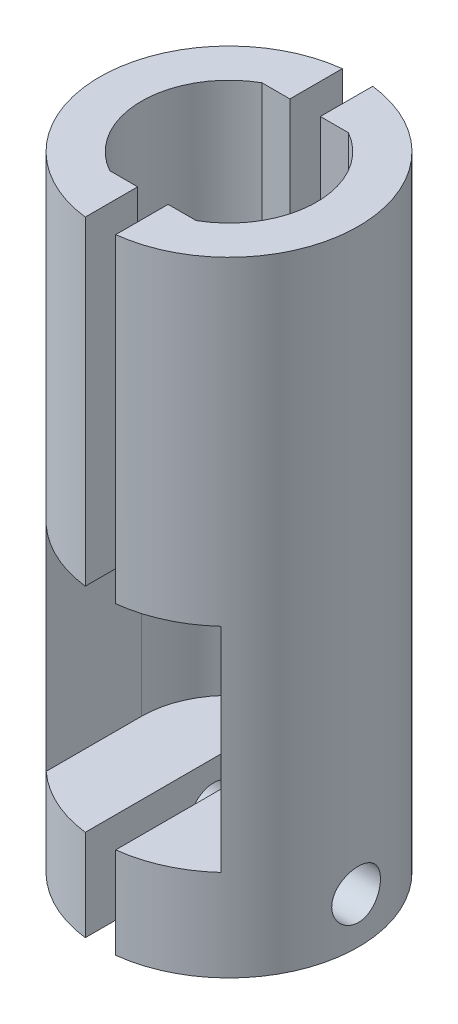
ISO-10303-21;
HEADER;
FILE_DESCRIPTION(('STEP AP214'),'2;1');
FILE_NAME('part.step','',(''),(''),'','','');
FILE_SCHEMA(('AUTOMOTIVE_DESIGN { 1 0 10303 214 1 1 1 1 }'));
ENDSEC;
DATA;
#1=APPLICATION_CONTEXT('core data for automotive mechanical design processes');
#2=APPLICATION_PROTOCOL_DEFINITION('international standard','automotive_design',2000,#1);
#3=PRODUCT_CONTEXT('',#1,'mechanical');
#4=PRODUCT('Part','Part','',(#3));
#5=PRODUCT_RELATED_PRODUCT_CATEGORY('part','',(#4));
#6=PRODUCT_DEFINITION_FORMATION('','',#4);
#7=PRODUCT_DEFINITION_CONTEXT('part definition',#1,'design');
#8=PRODUCT_DEFINITION('design','',#6,#7);
#9=PRODUCT_DEFINITION_SHAPE('','',#8);
#10=(LENGTH_UNIT() NAMED_UNIT(*) SI_UNIT(.MILLI.,.METRE.));
#11=(NAMED_UNIT(*) PLANE_ANGLE_UNIT() SI_UNIT($,.RADIAN.));
#12=(NAMED_UNIT(*) SI_UNIT($,.STERADIAN.) SOLID_ANGLE_UNIT());
#13=UNCERTAINTY_MEASURE_WITH_UNIT(LENGTH_MEASURE(1.E-05),#10,'distance_accuracy_value','');
#14=(GEOMETRIC_REPRESENTATION_CONTEXT(3) GLOBAL_UNCERTAINTY_ASSIGNED_CONTEXT((#13)) GLOBAL_UNIT_ASSIGNED_CONTEXT((#10,
#11,#12)) REPRESENTATION_CONTEXT('',''));
#15=CARTESIAN_POINT('',(0.,0.,0.));
#16=DIRECTION('',(0.,0.,1.));
#17=DIRECTION('',(1.,0.,0.));
#18=AXIS2_PLACEMENT_3D('',#15,#16,#17);
#19=CARTESIAN_POINT('',(0.,0.,0.));
#20=DIRECTION('',(0.,1.,0.));
#21=DIRECTION('',(0.,0.,1.));
#22=AXIS2_PLACEMENT_3D('',#19,#20,#21);
#23=PLANE('',#22);
#24=DIRECTION('',(0.,0.,-1.));
#25=VECTOR('',#24,1.);
#26=CARTESIAN_POINT('',(5.75,0.,0.));
#27=LINE('',#26,#25);
#28=CARTESIAN_POINT('',(5.75,0.,6.25999201277446));
#29=VERTEX_POINT('',#28);
#30=CARTESIAN_POINT('',(5.75,0.,0.));
#31=VERTEX_POINT('',#30);
#32=EDGE_CURVE('E67',#29,#31,#27,.T.);
#33=ORIENTED_EDGE('',*,*,#32,.F.);
#34=CARTESIAN_POINT('',(0.,0.,0.));
#35=DIRECTION('',(0.,1.,0.));
#36=DIRECTION('',(0.,0.,1.));
#37=AXIS2_PLACEMENT_3D('',#34,#35,#36);
#38=CIRCLE('',#37,8.5);
#39=CARTESIAN_POINT('',(1.,0.,8.44097150806707));
#40=VERTEX_POINT('',#39);
#41=EDGE_CURVE('E158',#40,#29,#38,.T.);
#42=ORIENTED_EDGE('',*,*,#41,.F.);
#43=DIRECTION('',(0.,0.,1.));
#44=VECTOR('',#43,1.);
#45=CARTESIAN_POINT('',(1.,0.,8.44097150806707));
#46=LINE('',#45,#44);
#47=CARTESIAN_POINT('',(1.,0.,5.));
#48=VERTEX_POINT('',#47);
#49=EDGE_CURVE('E95',#48,#40,#46,.T.);
#50=ORIENTED_EDGE('',*,*,#49,.F.);
#51=DIRECTION('',(-1.,0.,0.));
#52=VECTOR('',#51,1.);
#53=CARTESIAN_POINT('',(2.83945417290014,0.,5.));
#54=LINE('',#53,#52);
#55=CARTESIAN_POINT('',(2.83945417290014,0.,5.));
#56=VERTEX_POINT('',#55);
#57=EDGE_CURVE('E152',#56,#48,#54,.T.);
#58=ORIENTED_EDGE('',*,*,#57,.F.);
#59=CARTESIAN_POINT('',(0.,0.,0.));
#60=DIRECTION('',(0.,-1.,0.));
#61=DIRECTION('',(0.,0.,1.));
#62=AXIS2_PLACEMENT_3D('',#59,#60,#61);
#63=CIRCLE('',#62,5.75);
#64=EDGE_CURVE('E149',#31,#56,#63,.T.);
#65=ORIENTED_EDGE('',*,*,#64,.F.);
#66=EDGE_LOOP('',(#33,#42,#50,#58,#65));
#67=FACE_BOUND('',#66,.T.);
#68=ADVANCED_FACE('F50',(#67),#23,.F.);
#69=CARTESIAN_POINT('',(0.,21.,0.));
#70=DIRECTION('',(0.,-1.,0.));
#71=DIRECTION('',(0.,0.,-1.));
#72=AXIS2_PLACEMENT_3D('',#69,#70,#71);
#73=CYLINDRICAL_SURFACE('',#72,5.75);
#74=DIRECTION('',(0.,-1.,0.));
#75=VECTOR('',#74,1.);
#76=CARTESIAN_POINT('',(2.83945417290014,21.,-5.));
#77=LINE('',#76,#75);
#78=CARTESIAN_POINT('',(2.83945417290014,21.,-5.));
#79=VERTEX_POINT('',#78);
#80=CARTESIAN_POINT('',(2.83945417290014,-14.,-5.));
#81=VERTEX_POINT('',#80);
#82=EDGE_CURVE('E145',#79,#81,#77,.T.);
#83=ORIENTED_EDGE('',*,*,#82,.T.);
#84=CARTESIAN_POINT('',(0.,-14.,0.));
#85=DIRECTION('',(0.,1.,0.));
#86=DIRECTION('',(0.,0.,-1.));
#87=AXIS2_PLACEMENT_3D('',#84,#85,#86);
#88=CIRCLE('',#87,5.75);
#89=CARTESIAN_POINT('',(5.75,-14.,0.));
#90=VERTEX_POINT('',#89);
#91=EDGE_CURVE('E207',#90,#81,#88,.T.);
#92=ORIENTED_EDGE('',*,*,#91,.F.);
#93=DIRECTION('',(0.,1.,0.));
#94=VECTOR('',#93,1.);
#95=CARTESIAN_POINT('',(5.75,-14.,0.));
#96=LINE('',#95,#94);
#97=EDGE_CURVE('E187',#90,#31,#96,.T.);
#98=ORIENTED_EDGE('',*,*,#97,.T.);
#99=ORIENTED_EDGE('',*,*,#64,.T.);
#100=DIRECTION('',(0.,-1.,0.));
#101=VECTOR('',#100,1.);
#102=CARTESIAN_POINT('',(2.83945417290014,21.,5.));
#103=LINE('',#102,#101);
#104=CARTESIAN_POINT('',(2.83945417290014,21.,5.));
#105=VERTEX_POINT('',#104);
#106=EDGE_CURVE('E12',#105,#56,#103,.T.);
#107=ORIENTED_EDGE('',*,*,#106,.F.);
#108=CARTESIAN_POINT('',(0.,21.,0.));
#109=DIRECTION('',(0.,-1.,0.));
#110=DIRECTION('',(0.,0.,1.));
#111=AXIS2_PLACEMENT_3D('',#108,#109,#110);
#112=CIRCLE('',#111,5.75);
#113=EDGE_CURVE('E161',#79,#105,#112,.T.);
#114=ORIENTED_EDGE('',*,*,#113,.F.);
#115=EDGE_LOOP('',(#83,#92,#98,#99,#107,#114));
#116=FACE_BOUND('',#115,.T.);
#117=ADVANCED_FACE('F52',(#116),#73,.F.);
#118=CARTESIAN_POINT('',(2.83945417290014,21.,5.));
#119=DIRECTION('',(0.,0.,1.));
#120=DIRECTION('',(1.,0.,0.));
#121=AXIS2_PLACEMENT_3D('',#118,#119,#120);
#122=PLANE('',#121);
#123=ORIENTED_EDGE('',*,*,#57,.T.);
#124=DIRECTION('',(0.,-1.,0.));
#125=VECTOR('',#124,1.);
#126=CARTESIAN_POINT('',(1.,21.,5.));
#127=LINE('',#126,#125);
#128=CARTESIAN_POINT('',(1.,21.,5.));
#129=VERTEX_POINT('',#128);
#130=EDGE_CURVE('E60',#129,#48,#127,.T.);
#131=ORIENTED_EDGE('',*,*,#130,.F.);
#132=DIRECTION('',(-1.,0.,0.));
#133=VECTOR('',#132,1.);
#134=CARTESIAN_POINT('',(2.83945417290014,21.,5.));
#135=LINE('',#134,#133);
#136=EDGE_CURVE('E103',#105,#129,#135,.T.);
#137=ORIENTED_EDGE('',*,*,#136,.F.);
#138=ORIENTED_EDGE('',*,*,#106,.T.);
#139=EDGE_LOOP('',(#123,#131,#137,#138));
#140=FACE_BOUND('',#139,.T.);
#141=ADVANCED_FACE('F346',(#140),#122,.F.);
#142=CARTESIAN_POINT('',(1.,21.,8.44097150806707));
#143=DIRECTION('',(1.,0.,0.));
#144=DIRECTION('',(0.,0.,-1.));
#145=AXIS2_PLACEMENT_3D('',#142,#143,#144);
#146=PLANE('',#145);
#147=ORIENTED_EDGE('',*,*,#49,.T.);
#148=DIRECTION('',(0.,-1.,0.));
#149=VECTOR('',#148,1.);
#150=CARTESIAN_POINT('',(1.,21.,8.44097150806707));
#151=LINE('',#150,#149);
#152=CARTESIAN_POINT('',(1.,21.,8.44097150806707));
#153=VERTEX_POINT('',#152);
#154=EDGE_CURVE('E136',#153,#40,#151,.T.);
#155=ORIENTED_EDGE('',*,*,#154,.F.);
#156=DIRECTION('',(0.,0.,1.));
#157=VECTOR('',#156,1.);
#158=CARTESIAN_POINT('',(1.,21.,8.44097150806707));
#159=LINE('',#158,#157);
#160=EDGE_CURVE('E120',#129,#153,#159,.T.);
#161=ORIENTED_EDGE('',*,*,#160,.F.);
#162=ORIENTED_EDGE('',*,*,#130,.T.);
#163=EDGE_LOOP('',(#147,#155,#161,#162));
#164=FACE_BOUND('',#163,.T.);
#165=ADVANCED_FACE('F172',(#164),#146,.F.);
#166=CARTESIAN_POINT('',(0.,21.,0.));
#167=DIRECTION('',(0.,-1.,0.));
#168=DIRECTION('',(0.,0.,-1.));
#169=AXIS2_PLACEMENT_3D('',#166,#167,#168);
#170=CYLINDRICAL_SURFACE('',#169,8.5);
#171=CARTESIAN_POINT('',(8.34805366537614,-17.,-1.6));
#172=CARTESIAN_POINT('',(8.34805539139312,-17.08901429481,-1.59999659237136));
#173=CARTESIAN_POINT('',(8.34949285007406,-17.1780727251556,-1.59254647274993));
#174=CARTESIAN_POINT('',(8.35508013689202,-17.3536778830659,-1.56296320217409));
#175=CARTESIAN_POINT('',(8.35923225843588,-17.4402224222143,-1.54081763594649));
#176=CARTESIAN_POINT('',(8.36976232957171,-17.6082335493658,-1.48254805241547));
#177=CARTESIAN_POINT('',(8.37613819719878,-17.6897048033995,-1.44643710665958));
#178=CARTESIAN_POINT('',(8.39039489546249,-17.8454277461348,-1.36129650874434));
#179=CARTESIAN_POINT('',(8.39827561057117,-17.9196799883837,-1.31226784817517));
#180=CARTESIAN_POINT('',(8.41476444932436,-18.059793891304,-1.20202810484345));
#181=CARTESIAN_POINT('',(8.42337975336857,-18.1255518617491,-1.14068628665673));
#182=CARTESIAN_POINT('',(8.4403036356045,-18.2459070648873,-1.00784403878948));
#183=CARTESIAN_POINT('',(8.44861219355331,-18.3005035620826,-0.936342940177618));
#184=CARTESIAN_POINT('',(8.46406338192042,-18.3973836435837,-0.78453040775592));
#185=CARTESIAN_POINT('',(8.47119656563613,-18.4395694208936,-0.704155514043923));
#186=CARTESIAN_POINT('',(8.4834129002721,-18.5098003657707,-0.537302444088193));
#187=CARTESIAN_POINT('',(8.48849622105842,-18.5378467050791,-0.450824774261483));
#188=CARTESIAN_POINT('',(8.49598936058719,-18.5786818851825,-0.275295514300151));
#189=CARTESIAN_POINT('',(8.49842978798203,-18.5916455396787,-0.186285921125148));
#190=CARTESIAN_POINT('',(8.50046768283679,-18.6024920940253,-0.00732393707203556));
#191=CARTESIAN_POINT('',(8.50006539420488,-18.60037628771,0.082628372258711));
#192=CARTESIAN_POINT('',(8.49648709227791,-18.5812579656566,0.259723379907993));
#193=CARTESIAN_POINT('',(8.49334615271647,-18.5644436853824,0.346887210335064));
#194=CARTESIAN_POINT('',(8.4846828199301,-18.5167034702757,0.517133741524342));
#195=CARTESIAN_POINT('',(8.4791603394131,-18.4857770181787,0.600216292568581));
#196=CARTESIAN_POINT('',(8.46629586332026,-18.4105112776264,0.760487336625656));
#197=CARTESIAN_POINT('',(8.45894371458407,-18.3660968281687,0.837639684634008));
#198=CARTESIAN_POINT('',(8.443232823072,-18.2651712514084,0.983466653213873));
#199=CARTESIAN_POINT('',(8.43487397719485,-18.2086588846314,1.05214040398557));
#200=CARTESIAN_POINT('',(8.41792294108865,-18.0841046424359,1.18017616369996));
#201=CARTESIAN_POINT('',(8.40932914107406,-18.0158980837306,1.2393778645223));
#202=CARTESIAN_POINT('',(8.39300019745199,-17.8704399546852,1.34552615784017));
#203=CARTESIAN_POINT('',(8.38526506660615,-17.79318824995,1.39247256821015));
#204=CARTESIAN_POINT('',(8.3715268744211,-17.6316191549956,1.47282390487798));
#205=CARTESIAN_POINT('',(8.36552681767407,-17.5472898304832,1.50620538107589));
#206=CARTESIAN_POINT('',(8.35598401529582,-17.374081170092,1.55828078789123));
#207=CARTESIAN_POINT('',(8.35244098887193,-17.2852023553819,1.57697639686132));
#208=CARTESIAN_POINT('',(8.34826899194166,-17.1068636531414,1.59891499272747));
#209=CARTESIAN_POINT('',(8.34759657995444,-17.0174330931994,1.60238836190044));
#210=CARTESIAN_POINT('',(8.34912567503967,-16.8392698845232,1.59440158482373));
#211=CARTESIAN_POINT('',(8.35132703880459,-16.7505372012096,1.58294218323161));
#212=CARTESIAN_POINT('',(8.35831516898331,-16.5770469159443,1.545612979683));
#213=CARTESIAN_POINT('',(8.36308023285296,-16.4922623458804,1.51986408607974));
#214=CARTESIAN_POINT('',(8.37464014305879,-16.3282108958354,1.4548151616231));
#215=CARTESIAN_POINT('',(8.38143514001204,-16.2489444258249,1.41551412519378));
#216=CARTESIAN_POINT('',(8.39638814039238,-16.0971647130587,1.32394678397368));
#217=CARTESIAN_POINT('',(8.40456107512384,-16.0247407217508,1.27153502275713));
#218=CARTESIAN_POINT('',(8.42130712442404,-15.8896321143246,1.15543002300358));
#219=CARTESIAN_POINT('',(8.42988027521774,-15.8269483820626,1.0917357617843));
#220=CARTESIAN_POINT('',(8.4466004537163,-15.7122382179163,0.95384455126335));
#221=CARTESIAN_POINT('',(8.45474018272925,-15.6603667751443,0.879517643457106));
#222=CARTESIAN_POINT('',(8.46955334256691,-15.5698477950037,0.723070473516724));
#223=CARTESIAN_POINT('',(8.47622683014965,-15.5311997457269,0.640950513226994));
#224=CARTESIAN_POINT('',(8.48732421075794,-15.4684562930651,0.471675368107009));
#225=CARTESIAN_POINT('',(8.4917598217086,-15.4442849596637,0.384549129377305));
#226=CARTESIAN_POINT('',(8.49793167851094,-15.410938852575,0.207382225845221));
#227=CARTESIAN_POINT('',(8.49966821072667,-15.4017624879616,0.117341871256595));
#228=CARTESIAN_POINT('',(8.50024049408447,-15.3987225473693,-0.0616113364084071));
#229=CARTESIAN_POINT('',(8.49912057850766,-15.4046249448959,-0.150520156732278));
#230=CARTESIAN_POINT('',(8.49419798888985,-15.431062186126,-0.326055196411809));
#231=CARTESIAN_POINT('',(8.49039534100491,-15.4515968871677,-0.412681438013585));
#232=CARTESIAN_POINT('',(8.48053460772706,-15.5066169030027,-0.581067360603543));
#233=CARTESIAN_POINT('',(8.47448058103017,-15.5410771230533,-0.662835493807117));
#234=CARTESIAN_POINT('',(8.46077225021937,-15.6229418376903,-0.819463917643094));
#235=CARTESIAN_POINT('',(8.45311783777303,-15.6703472086192,-0.894323740147238));
#236=CARTESIAN_POINT('',(8.43691387433263,-15.7775611787387,-1.03617620036631));
#237=CARTESIAN_POINT('',(8.4283530081433,-15.8375387576422,-1.10303984312601));
#238=CARTESIAN_POINT('',(8.41137217193159,-15.9678441605316,-1.22583453399441));
#239=CARTESIAN_POINT('',(8.40295223553237,-16.0381744163466,-1.2817630062408));
#240=CARTESIAN_POINT('',(8.38712064238058,-16.1879745166557,-1.38159072893547));
#241=CARTESIAN_POINT('',(8.37971913443067,-16.2675235691439,-1.42537278168145));
#242=CARTESIAN_POINT('',(8.366884638499,-16.4329619400564,-1.49888133023776));
#243=CARTESIAN_POINT('',(8.36144979763857,-16.5188451984237,-1.52862106399658));
#244=CARTESIAN_POINT('',(8.35429445142774,-16.67081553301,-1.5671724971974));
#245=CARTESIAN_POINT('',(8.35196808950014,-16.7360141575649,-1.57946165921837));
#246=CARTESIAN_POINT('',(8.34884707503259,-16.8674670511938,-1.59587656657863));
#247=CARTESIAN_POINT('',(8.34805238020979,-16.9337212910758,-1.60000253726918));
#248=CARTESIAN_POINT('',(8.34805366537614,-17.,-1.6));
#249=B_SPLINE_CURVE_WITH_KNOTS('',3,(#171,#172,#173,#174,#175,#176,#177,#178,#179,#180,#181,
#182,#183,#184,#185,#186,#187,#188,#189,#190,#191,#192,#193,#194,#195,#196,#197,#198,#199,#200,
#201,#202,#203,#204,#205,#206,#207,#208,#209,#210,#211,#212,#213,#214,#215,#216,#217,#218,#219,
#220,#221,#222,#223,#224,#225,#226,#227,#228,#229,#230,#231,#232,#233,#234,#235,#236,#237,#238,
#239,#240,#241,#242,#243,#244,#245,#246,#247,#248),.UNSPECIFIED.,.T.,.F.,(4,2,2,2,2,2,2,2,2,2,2,
2,2,2,2,2,2,2,2,2,2,2,2,2,2,2,2,2,2,2,2,2,2,2,2,2,2,2,4),(0.,0.266800328829506,
0.533826348201635,0.800603034687953,1.06735924881431,1.33711378261321,1.60688608646526,
1.87873072554757,2.15055283304115,2.41919201121194,2.68780814012356,2.95303382613267,
3.21826923444666,3.48501064893548,3.75177940511555,4.02267088443979,4.29356638924618,
4.56492822695457,4.83625904796217,5.10346888791314,5.37066540333029,5.63563480731666,
5.90062387640079,6.16869446251957,6.43678935986868,6.70849683925369,6.9801937990206,
7.25045294302678,7.5206834114,7.78674539377935,8.05280478214665,8.31838683622141,
8.58398687375371,8.85341644178676,9.12290939973647,9.39491871729081,9.66667109222014,
9.86533209999876,10.0639876235088),.UNSPECIFIED.);
#250=CARTESIAN_POINT('',(8.34805366537614,-17.,-1.6));
#251=VERTEX_POINT('',#250);
#252=EDGE_CURVE('E204',#251,#251,#249,.T.);
#253=ORIENTED_EDGE('',*,*,#252,.T.);
#254=EDGE_LOOP('',(#253));
#255=FACE_BOUND('',#254,.T.);
#256=ORIENTED_EDGE('',*,*,#41,.T.);
#257=DIRECTION('',(0.,1.,0.));
#258=VECTOR('',#257,1.);
#259=CARTESIAN_POINT('',(5.75,-14.,6.25999201277446));
#260=LINE('',#259,#258);
#261=CARTESIAN_POINT('',(5.75,-14.,6.25999201277446));
#262=VERTEX_POINT('',#261);
#263=EDGE_CURVE('E153',#262,#29,#260,.T.);
#264=ORIENTED_EDGE('',*,*,#263,.F.);
#265=CARTESIAN_POINT('',(0.,-14.,0.));
#266=DIRECTION('',(0.,-1.,0.));
#267=DIRECTION('',(0.,0.,-1.));
#268=AXIS2_PLACEMENT_3D('',#265,#266,#267);
#269=CIRCLE('',#268,8.5);
#270=CARTESIAN_POINT('',(1.,-14.,8.44097150806707));
#271=VERTEX_POINT('',#270);
#272=EDGE_CURVE('E202',#262,#271,#269,.T.);
#273=ORIENTED_EDGE('',*,*,#272,.T.);
#274=DIRECTION('',(0.,1.,0.));
#275=VECTOR('',#274,1.);
#276=CARTESIAN_POINT('',(1.,-20.,8.44097150806707));
#277=LINE('',#276,#275);
#278=CARTESIAN_POINT('',(1.,-20.,8.44097150806707));
#279=VERTEX_POINT('',#278);
#280=EDGE_CURVE('E200',#279,#271,#277,.T.);
#281=ORIENTED_EDGE('',*,*,#280,.F.);
#282=CARTESIAN_POINT('',(0.,-20.,0.));
#283=DIRECTION('',(0.,-1.,0.));
#284=DIRECTION('',(0.,0.,-1.));
#285=AXIS2_PLACEMENT_3D('',#282,#283,#284);
#286=CIRCLE('',#285,8.5);
#287=CARTESIAN_POINT('',(1.,-20.,-8.44097150806707));
#288=VERTEX_POINT('',#287);
#289=EDGE_CURVE('E131',#288,#279,#286,.T.);
#290=ORIENTED_EDGE('',*,*,#289,.F.);
#291=DIRECTION('',(0.,-1.,0.));
#292=VECTOR('',#291,1.);
#293=CARTESIAN_POINT('',(1.,21.,-8.44097150806707));
#294=LINE('',#293,#292);
#295=CARTESIAN_POINT('',(1.,21.,-8.44097150806707));
#296=VERTEX_POINT('',#295);
#297=EDGE_CURVE('E126',#296,#288,#294,.T.);
#298=ORIENTED_EDGE('',*,*,#297,.F.);
#299=CARTESIAN_POINT('',(0.,21.,0.));
#300=DIRECTION('',(0.,1.,0.));
#301=DIRECTION('',(0.,0.,1.));
#302=AXIS2_PLACEMENT_3D('',#299,#300,#301);
#303=CIRCLE('',#302,8.5);
#304=EDGE_CURVE('E113',#153,#296,#303,.T.);
#305=ORIENTED_EDGE('',*,*,#304,.F.);
#306=ORIENTED_EDGE('',*,*,#154,.T.);
#307=EDGE_LOOP('',(#256,#264,#273,#281,#290,#298,#305,#306));
#308=FACE_BOUND('',#307,.T.);
#309=ADVANCED_FACE('F127',(#255,#308),#170,.T.);
#310=CARTESIAN_POINT('',(1.,21.,-8.44097150806707));
#311=DIRECTION('',(1.,0.,0.));
#312=DIRECTION('',(0.,0.,-1.));
#313=AXIS2_PLACEMENT_3D('',#310,#311,#312);
#314=PLANE('',#313);
#315=CARTESIAN_POINT('',(1.,-17.,0.));
#316=DIRECTION('',(1.,0.,0.));
#317=DIRECTION('',(0.,0.,-1.));
#318=AXIS2_PLACEMENT_3D('',#315,#316,#317);
#319=CIRCLE('',#318,1.6);
#320=CARTESIAN_POINT('',(1.,-17.,-1.6));
#321=VERTEX_POINT('',#320);
#322=EDGE_CURVE('E54',#321,#321,#319,.T.);
#323=ORIENTED_EDGE('',*,*,#322,.T.);
#324=EDGE_LOOP('',(#323));
#325=FACE_BOUND('',#324,.T.);
#326=ORIENTED_EDGE('',*,*,#297,.T.);
#327=DIRECTION('',(0.,0.,-1.));
#328=VECTOR('',#327,1.);
#329=CARTESIAN_POINT('',(1.,-20.,8.44097150806707));
#330=LINE('',#329,#328);
#331=EDGE_CURVE('E210',#279,#288,#330,.T.);
#332=ORIENTED_EDGE('',*,*,#331,.F.);
#333=ORIENTED_EDGE('',*,*,#280,.T.);
#334=DIRECTION('',(0.,0.,-1.));
#335=VECTOR('',#334,1.);
#336=CARTESIAN_POINT('',(1.,-14.,8.44097150806707));
#337=LINE('',#336,#335);
#338=CARTESIAN_POINT('',(1.,-14.,-5.));
#339=VERTEX_POINT('',#338);
#340=EDGE_CURVE('E203',#271,#339,#337,.T.);
#341=ORIENTED_EDGE('',*,*,#340,.T.);
#342=DIRECTION('',(0.,-1.,0.));
#343=VECTOR('',#342,1.);
#344=CARTESIAN_POINT('',(1.,21.,-5.));
#345=LINE('',#344,#343);
#346=CARTESIAN_POINT('',(1.,21.,-5.));
#347=VERTEX_POINT('',#346);
#348=EDGE_CURVE('E137',#347,#339,#345,.T.);
#349=ORIENTED_EDGE('',*,*,#348,.F.);
#350=DIRECTION('',(0.,0.,1.));
#351=VECTOR('',#350,1.);
#352=CARTESIAN_POINT('',(1.,21.,-8.44097150806707));
#353=LINE('',#352,#351);
#354=EDGE_CURVE('E117',#296,#347,#353,.T.);
#355=ORIENTED_EDGE('',*,*,#354,.F.);
#356=EDGE_LOOP('',(#326,#332,#333,#341,#349,#355));
#357=FACE_BOUND('',#356,.T.);
#358=ADVANCED_FACE('F139',(#325,#357),#314,.F.);
#359=CARTESIAN_POINT('',(2.83945417290014,21.,-5.));
#360=DIRECTION('',(0.,0.,-1.));
#361=DIRECTION('',(-1.,0.,0.));
#362=AXIS2_PLACEMENT_3D('',#359,#360,#361);
#363=PLANE('',#362);
#364=ORIENTED_EDGE('',*,*,#348,.T.);
#365=DIRECTION('',(-1.,0.,0.));
#366=VECTOR('',#365,1.);
#367=CARTESIAN_POINT('',(1.,-14.,-5.));
#368=LINE('',#367,#366);
#369=EDGE_CURVE('E191',#81,#339,#368,.T.);
#370=ORIENTED_EDGE('',*,*,#369,.F.);
#371=ORIENTED_EDGE('',*,*,#82,.F.);
#372=DIRECTION('',(1.,0.,0.));
#373=VECTOR('',#372,1.);
#374=CARTESIAN_POINT('',(2.83945417290014,21.,-5.));
#375=LINE('',#374,#373);
#376=EDGE_CURVE('E76',#347,#79,#375,.T.);
#377=ORIENTED_EDGE('',*,*,#376,.F.);
#378=EDGE_LOOP('',(#364,#370,#371,#377));
#379=FACE_BOUND('',#378,.T.);
#380=ADVANCED_FACE('F250',(#379),#363,.F.);
#381=CARTESIAN_POINT('',(0.,21.,0.));
#382=DIRECTION('',(0.,1.,0.));
#383=DIRECTION('',(0.,0.,1.));
#384=AXIS2_PLACEMENT_3D('',#381,#382,#383);
#385=PLANE('',#384);
#386=ORIENTED_EDGE('',*,*,#113,.T.);
#387=ORIENTED_EDGE('',*,*,#136,.T.);
#388=ORIENTED_EDGE('',*,*,#160,.T.);
#389=ORIENTED_EDGE('',*,*,#304,.T.);
#390=ORIENTED_EDGE('',*,*,#354,.T.);
#391=ORIENTED_EDGE('',*,*,#376,.T.);
#392=EDGE_LOOP('',(#386,#387,#388,#389,#390,#391));
#393=FACE_BOUND('',#392,.T.);
#394=ADVANCED_FACE('F115',(#393),#385,.T.);
#395=CARTESIAN_POINT('',(5.75,-14.,0.));
#396=DIRECTION('',(1.,0.,0.));
#397=DIRECTION('',(0.,0.,-1.));
#398=AXIS2_PLACEMENT_3D('',#395,#396,#397);
#399=PLANE('',#398);
#400=ORIENTED_EDGE('',*,*,#32,.T.);
#401=ORIENTED_EDGE('',*,*,#97,.F.);
#402=DIRECTION('',(0.,0.,-1.));
#403=VECTOR('',#402,1.);
#404=CARTESIAN_POINT('',(5.75,-14.,0.));
#405=LINE('',#404,#403);
#406=EDGE_CURVE('E185',#262,#90,#405,.T.);
#407=ORIENTED_EDGE('',*,*,#406,.F.);
#408=ORIENTED_EDGE('',*,*,#263,.T.);
#409=EDGE_LOOP('',(#400,#401,#407,#408));
#410=FACE_BOUND('',#409,.T.);
#411=ADVANCED_FACE('F181',(#410),#399,.F.);
#412=CARTESIAN_POINT('',(0.,-14.,0.));
#413=DIRECTION('',(0.,-1.,0.));
#414=DIRECTION('',(0.,0.,-1.));
#415=AXIS2_PLACEMENT_3D('',#412,#413,#414);
#416=PLANE('',#415);
#417=ORIENTED_EDGE('',*,*,#272,.F.);
#418=ORIENTED_EDGE('',*,*,#406,.T.);
#419=ORIENTED_EDGE('',*,*,#91,.T.);
#420=ORIENTED_EDGE('',*,*,#369,.T.);
#421=ORIENTED_EDGE('',*,*,#340,.F.);
#422=EDGE_LOOP('',(#417,#418,#419,#420,#421));
#423=FACE_BOUND('',#422,.T.);
#424=ADVANCED_FACE('F241',(#423),#416,.F.);
#425=CARTESIAN_POINT('',(0.,-20.,0.));
#426=DIRECTION('',(0.,-1.,0.));
#427=DIRECTION('',(0.,0.,-1.));
#428=AXIS2_PLACEMENT_3D('',#425,#426,#427);
#429=PLANE('',#428);
#430=ORIENTED_EDGE('',*,*,#289,.T.);
#431=ORIENTED_EDGE('',*,*,#331,.T.);
#432=EDGE_LOOP('',(#430,#431));
#433=FACE_BOUND('',#432,.T.);
#434=ADVANCED_FACE('F237',(#433),#429,.T.);
#435=CARTESIAN_POINT('',(-8.5,-17.,0.));
#436=DIRECTION('',(1.,0.,0.));
#437=DIRECTION('',(0.,0.,-1.));
#438=AXIS2_PLACEMENT_3D('',#435,#436,#437);
#439=CYLINDRICAL_SURFACE('',#438,1.6);
#440=ORIENTED_EDGE('',*,*,#322,.F.);
#441=EDGE_LOOP('',(#440));
#442=FACE_BOUND('',#441,.T.);
#443=ORIENTED_EDGE('',*,*,#252,.F.);
#444=EDGE_LOOP('',(#443));
#445=FACE_BOUND('',#444,.T.);
#446=ADVANCED_FACE('F233',(#442,#445),#439,.F.);
#447=CLOSED_SHELL('',(#68,#117,#141,#165,#309,#358,#380,#394,#411,#424,#434,#446));
#448=MANIFOLD_SOLID_BREP('B2',#447);
#449=CARTESIAN_POINT('',(0.,0.,0.));
#450=DIRECTION('',(0.,1.,0.));
#451=DIRECTION('',(0.,0.,1.));
#452=AXIS2_PLACEMENT_3D('',#449,#450,#451);
#453=PLANE('',#452);
#454=DIRECTION('',(0.,0.,1.));
#455=VECTOR('',#454,1.);
#456=CARTESIAN_POINT('',(-5.75,0.,0.));
#457=LINE('',#456,#455);
#458=CARTESIAN_POINT('',(-5.75,0.,0.));
#459=VERTEX_POINT('',#458);
#460=CARTESIAN_POINT('',(-5.75,0.,6.25999201277446));
#461=VERTEX_POINT('',#460);
#462=EDGE_CURVE('E421',#459,#461,#457,.T.);
#463=ORIENTED_EDGE('',*,*,#462,.F.);
#464=CARTESIAN_POINT('',(0.,0.,0.));
#465=DIRECTION('',(0.,-1.,0.));
#466=DIRECTION('',(0.,0.,1.));
#467=AXIS2_PLACEMENT_3D('',#464,#465,#466);
#468=CIRCLE('',#467,5.75);
#469=CARTESIAN_POINT('',(-2.83945417290014,0.,5.));
#470=VERTEX_POINT('',#469);
#471=EDGE_CURVE('E500',#470,#459,#468,.T.);
#472=ORIENTED_EDGE('',*,*,#471,.F.);
#473=DIRECTION('',(-1.,0.,0.));
#474=VECTOR('',#473,1.);
#475=CARTESIAN_POINT('',(-1.,0.,5.));
#476=LINE('',#475,#474);
#477=CARTESIAN_POINT('',(-1.,0.,5.));
#478=VERTEX_POINT('',#477);
#479=EDGE_CURVE('E448',#478,#470,#476,.T.);
#480=ORIENTED_EDGE('',*,*,#479,.F.);
#481=DIRECTION('',(0.,0.,-1.));
#482=VECTOR('',#481,1.);
#483=CARTESIAN_POINT('',(-1.,0.,8.44097150806707));
#484=LINE('',#483,#482);
#485=CARTESIAN_POINT('',(-1.,0.,8.44097150806707));
#486=VERTEX_POINT('',#485);
#487=EDGE_CURVE('E506',#486,#478,#484,.T.);
#488=ORIENTED_EDGE('',*,*,#487,.F.);
#489=CARTESIAN_POINT('',(0.,0.,0.));
#490=DIRECTION('',(0.,1.,0.));
#491=DIRECTION('',(0.,0.,1.));
#492=AXIS2_PLACEMENT_3D('',#489,#490,#491);
#493=CIRCLE('',#492,8.5);
#494=EDGE_CURVE('E484',#461,#486,#493,.T.);
#495=ORIENTED_EDGE('',*,*,#494,.F.);
#496=EDGE_LOOP('',(#463,#472,#480,#488,#495));
#497=FACE_BOUND('',#496,.T.);
#498=ADVANCED_FACE('F401',(#497),#453,.F.);
#499=CARTESIAN_POINT('',(0.,21.,0.));
#500=DIRECTION('',(0.,-1.,0.));
#501=DIRECTION('',(0.,0.,-1.));
#502=AXIS2_PLACEMENT_3D('',#499,#500,#501);
#503=CYLINDRICAL_SURFACE('',#502,5.75);
#504=ORIENTED_EDGE('',*,*,#471,.T.);
#505=DIRECTION('',(0.,1.,0.));
#506=VECTOR('',#505,1.);
#507=CARTESIAN_POINT('',(-5.75,-14.,0.));
#508=LINE('',#507,#506);
#509=CARTESIAN_POINT('',(-5.75,-14.,0.));
#510=VERTEX_POINT('',#509);
#511=EDGE_CURVE('E503',#510,#459,#508,.T.);
#512=ORIENTED_EDGE('',*,*,#511,.F.);
#513=CARTESIAN_POINT('',(0.,-14.,0.));
#514=DIRECTION('',(0.,1.,0.));
#515=DIRECTION('',(0.,0.,-1.));
#516=AXIS2_PLACEMENT_3D('',#513,#514,#515);
#517=CIRCLE('',#516,5.75);
#518=CARTESIAN_POINT('',(-2.83945417290014,-14.,-5.));
#519=VERTEX_POINT('',#518);
#520=EDGE_CURVE('E542',#519,#510,#517,.T.);
#521=ORIENTED_EDGE('',*,*,#520,.F.);
#522=DIRECTION('',(0.,-1.,0.));
#523=VECTOR('',#522,1.);
#524=CARTESIAN_POINT('',(-2.83945417290014,21.,-5.));
#525=LINE('',#524,#523);
#526=CARTESIAN_POINT('',(-2.83945417290014,21.,-5.));
#527=VERTEX_POINT('',#526);
#528=EDGE_CURVE('E414',#527,#519,#525,.T.);
#529=ORIENTED_EDGE('',*,*,#528,.F.);
#530=CARTESIAN_POINT('',(0.,21.,0.));
#531=DIRECTION('',(0.,-1.,0.));
#532=DIRECTION('',(0.,0.,1.));
#533=AXIS2_PLACEMENT_3D('',#530,#531,#532);
#534=CIRCLE('',#533,5.75);
#535=CARTESIAN_POINT('',(-2.83945417290014,21.,5.));
#536=VERTEX_POINT('',#535);
#537=EDGE_CURVE('E511',#536,#527,#534,.T.);
#538=ORIENTED_EDGE('',*,*,#537,.F.);
#539=DIRECTION('',(0.,-1.,0.));
#540=VECTOR('',#539,1.);
#541=CARTESIAN_POINT('',(-2.83945417290014,21.,5.));
#542=LINE('',#541,#540);
#543=EDGE_CURVE('E496',#536,#470,#542,.T.);
#544=ORIENTED_EDGE('',*,*,#543,.T.);
#545=EDGE_LOOP('',(#504,#512,#521,#529,#538,#544));
#546=FACE_BOUND('',#545,.T.);
#547=ADVANCED_FACE('F403',(#546),#503,.F.);
#548=CARTESIAN_POINT('',(-1.,21.,-5.));
#549=DIRECTION('',(0.,0.,-1.));
#550=DIRECTION('',(-1.,0.,0.));
#551=AXIS2_PLACEMENT_3D('',#548,#549,#550);
#552=PLANE('',#551);
#553=ORIENTED_EDGE('',*,*,#528,.T.);
#554=DIRECTION('',(-1.,0.,0.));
#555=VECTOR('',#554,1.);
#556=CARTESIAN_POINT('',(-2.83945417290014,-14.,-5.));
#557=LINE('',#556,#555);
#558=CARTESIAN_POINT('',(-1.,-14.,-5.));
#559=VERTEX_POINT('',#558);
#560=EDGE_CURVE('E530',#559,#519,#557,.T.);
#561=ORIENTED_EDGE('',*,*,#560,.F.);
#562=DIRECTION('',(0.,-1.,0.));
#563=VECTOR('',#562,1.);
#564=CARTESIAN_POINT('',(-1.,21.,-5.));
#565=LINE('',#564,#563);
#566=CARTESIAN_POINT('',(-1.,21.,-5.));
#567=VERTEX_POINT('',#566);
#568=EDGE_CURVE('E518',#567,#559,#565,.T.);
#569=ORIENTED_EDGE('',*,*,#568,.F.);
#570=DIRECTION('',(1.,0.,0.));
#571=VECTOR('',#570,1.);
#572=CARTESIAN_POINT('',(-1.,21.,-5.));
#573=LINE('',#572,#571);
#574=EDGE_CURVE('E457',#527,#567,#573,.T.);
#575=ORIENTED_EDGE('',*,*,#574,.F.);
#576=EDGE_LOOP('',(#553,#561,#569,#575));
#577=FACE_BOUND('',#576,.T.);
#578=ADVANCED_FACE('F529',(#577),#552,.F.);
#579=CARTESIAN_POINT('',(-1.,21.,-8.44097150806707));
#580=DIRECTION('',(-1.,0.,0.));
#581=DIRECTION('',(0.,0.,1.));
#582=AXIS2_PLACEMENT_3D('',#579,#580,#581);
#583=PLANE('',#582);
#584=CARTESIAN_POINT('',(-1.,-17.,0.));
#585=DIRECTION('',(-1.,0.,0.));
#586=DIRECTION('',(0.,0.,1.));
#587=AXIS2_PLACEMENT_3D('',#584,#585,#586);
#588=CIRCLE('',#587,1.6);
#589=CARTESIAN_POINT('',(-1.,-17.,1.6));
#590=VERTEX_POINT('',#589);
#591=EDGE_CURVE('E580',#590,#590,#588,.T.);
#592=ORIENTED_EDGE('',*,*,#591,.T.);
#593=EDGE_LOOP('',(#592));
#594=FACE_BOUND('',#593,.T.);
#595=ORIENTED_EDGE('',*,*,#568,.T.);
#596=DIRECTION('',(0.,0.,1.));
#597=VECTOR('',#596,1.);
#598=CARTESIAN_POINT('',(-1.,-14.,8.44097150806707));
#599=LINE('',#598,#597);
#600=CARTESIAN_POINT('',(-1.,-14.,8.44097150806707));
#601=VERTEX_POINT('',#600);
#602=EDGE_CURVE('E545',#559,#601,#599,.T.);
#603=ORIENTED_EDGE('',*,*,#602,.T.);
#604=DIRECTION('',(0.,1.,0.));
#605=VECTOR('',#604,1.);
#606=CARTESIAN_POINT('',(-1.,-20.,8.44097150806707));
#607=LINE('',#606,#605);
#608=CARTESIAN_POINT('',(-1.,-20.,8.44097150806707));
#609=VERTEX_POINT('',#608);
#610=EDGE_CURVE('E557',#609,#601,#607,.T.);
#611=ORIENTED_EDGE('',*,*,#610,.F.);
#612=DIRECTION('',(0.,0.,1.));
#613=VECTOR('',#612,1.);
#614=CARTESIAN_POINT('',(-1.,-20.,8.44097150806707));
#615=LINE('',#614,#613);
#616=CARTESIAN_POINT('',(-0.999999999999997,-20.,-8.44097150806707));
#617=VERTEX_POINT('',#616);
#618=EDGE_CURVE('E568',#617,#609,#615,.T.);
#619=ORIENTED_EDGE('',*,*,#618,.F.);
#620=DIRECTION('',(0.,-1.,0.));
#621=VECTOR('',#620,1.);
#622=CARTESIAN_POINT('',(-0.999999999999997,21.,-8.44097150806707));
#623=LINE('',#622,#621);
#624=CARTESIAN_POINT('',(-0.999999999999997,21.,-8.44097150806707));
#625=VERTEX_POINT('',#624);
#626=EDGE_CURVE('E488',#625,#617,#623,.T.);
#627=ORIENTED_EDGE('',*,*,#626,.F.);
#628=DIRECTION('',(0.,0.,-1.));
#629=VECTOR('',#628,1.);
#630=CARTESIAN_POINT('',(-1.,21.,-8.44097150806707));
#631=LINE('',#630,#629);
#632=EDGE_CURVE('E474',#567,#625,#631,.T.);
#633=ORIENTED_EDGE('',*,*,#632,.F.);
#634=EDGE_LOOP('',(#595,#603,#611,#619,#627,#633));
#635=FACE_BOUND('',#634,.T.);
#636=ADVANCED_FACE('F598',(#594,#635),#583,.F.);
#637=CARTESIAN_POINT('',(0.,21.,0.));
#638=DIRECTION('',(0.,-1.,0.));
#639=DIRECTION('',(0.,0.,-1.));
#640=AXIS2_PLACEMENT_3D('',#637,#638,#639);
#641=CYLINDRICAL_SURFACE('',#640,8.5);
#642=CARTESIAN_POINT('',(-8.5,-18.6,0.));
#643=CARTESIAN_POINT('',(-8.4999983854735,-18.5999966048925,-0.089030046047769));
#644=CARTESIAN_POINT('',(-8.49858679537274,-18.5925439376005,-0.178104192690127));
#645=CARTESIAN_POINT('',(-8.49309174657167,-18.5629496305241,-0.353741987310882));
#646=CARTESIAN_POINT('',(-8.48900604050094,-18.5407956352874,-0.440303459636673));
#647=CARTESIAN_POINT('',(-8.47861975095211,-18.482501407222,-0.608350440487746));
#648=CARTESIAN_POINT('',(-8.47232117516634,-18.4463738493379,-0.68984047160301));
#649=CARTESIAN_POINT('',(-8.45819676654569,-18.3611940973869,-0.84559504453781));
#650=CARTESIAN_POINT('',(-8.45037105547103,-18.3121429336245,-0.919860161700885));
#651=CARTESIAN_POINT('',(-8.43395042839482,-18.2018801655344,-1.05996022512775));
#652=CARTESIAN_POINT('',(-8.42534811380332,-18.1405428763847,-1.12569539691746));
#653=CARTESIAN_POINT('',(-8.40839866459197,-18.0077193499506,-1.24600639863087));
#654=CARTESIAN_POINT('',(-8.40005154842921,-17.9362323806965,-1.30058142301909));
#655=CARTESIAN_POINT('',(-8.38448564732721,-17.7844329194086,-1.39743848351826));
#656=CARTESIAN_POINT('',(-8.37727640039131,-17.7040545375707,-1.43961892146727));
#657=CARTESIAN_POINT('',(-8.36490678259395,-17.5371939155321,-1.50983904195442));
#658=CARTESIAN_POINT('',(-8.35974623359362,-17.4507122067997,-1.53787995401318));
#659=CARTESIAN_POINT('',(-8.35213279085671,-17.2751677350879,-1.57870462357269));
#660=CARTESIAN_POINT('',(-8.34964903187494,-17.1861468170376,-1.59166244228772));
#661=CARTESIAN_POINT('',(-8.3475773395111,-17.0071624481949,-1.60249339740365));
#662=CARTESIAN_POINT('',(-8.34798914437535,-16.9171990833321,-1.60036789730891));
#663=CARTESIAN_POINT('',(-8.35163395330628,-16.7401453200554,-1.58123366787547));
#664=CARTESIAN_POINT('',(-8.35482941984687,-16.6530326345488,-1.56442295937635));
#665=CARTESIAN_POINT('',(-8.36362253339816,-16.4828865246102,-1.51670740147855));
#666=CARTESIAN_POINT('',(-8.36922028321199,-16.3998532749229,-1.48580194890685));
#667=CARTESIAN_POINT('',(-8.38222642859831,-16.2396441456605,-1.41058079922372));
#668=CARTESIAN_POINT('',(-8.3896455567598,-16.1625066757683,-1.36618522794984));
#669=CARTESIAN_POINT('',(-8.40545142423905,-16.0167015737507,-1.26530055041287));
#670=CARTESIAN_POINT('',(-8.41383826246389,-15.9480348088802,-1.20881020746962));
#671=CARTESIAN_POINT('',(-8.43079807065514,-15.819976290052,-1.08427232419692));
#672=CARTESIAN_POINT('',(-8.43937188087617,-15.7607492208142,-1.01605543150069));
#673=CARTESIAN_POINT('',(-8.45561715497978,-15.654554565051,-0.870567339654018));
#674=CARTESIAN_POINT('',(-8.46328860967938,-15.6075871032817,-0.793296048375958));
#675=CARTESIAN_POINT('',(-8.47688047841647,-15.5272202760785,-0.631720181931719));
#676=CARTESIAN_POINT('',(-8.48279866682323,-15.4938381362118,-0.547406839924082));
#677=CARTESIAN_POINT('',(-8.49220000098537,-15.4417565757242,-0.374233128242911));
#678=CARTESIAN_POINT('',(-8.49568340747661,-15.4230555829027,-0.285373246543196));
#679=CARTESIAN_POINT('',(-8.49978684900518,-15.4010966190016,-0.107045610580803));
#680=CARTESIAN_POINT('',(-8.50044871541265,-15.3976130197348,-0.0176065712274412));
#681=CARTESIAN_POINT('',(-8.49895008996443,-15.4055823656142,0.160575993885683));
#682=CARTESIAN_POINT('',(-8.49678973791129,-15.4170345708945,0.249319553877922));
#683=CARTESIAN_POINT('',(-8.48991547305202,-15.4543628631013,0.422875696254094));
#684=CARTESIAN_POINT('',(-8.48522179654942,-15.480124691043,0.507713724781879));
#685=CARTESIAN_POINT('',(-8.4738050236667,-15.5452172299945,0.67186641809088));
#686=CARTESIAN_POINT('',(-8.46708178865937,-15.5845488679042,0.751180705122244));
#687=CARTESIAN_POINT('',(-8.45224732976867,-15.6761632847884,0.902996744551666));
#688=CARTESIAN_POINT('',(-8.44412164667636,-15.7285838143842,0.975413928619641));
#689=CARTESIAN_POINT('',(-8.4274207608166,-15.8447016980923,1.1105047649803));
#690=CARTESIAN_POINT('',(-8.41884551577532,-15.9084001140458,1.17317749876407));
#691=CARTESIAN_POINT('',(-8.402073086774,-16.0462873907699,1.28785850008397));
#692=CARTESIAN_POINT('',(-8.39388250232818,-16.1206052951213,1.33971273769902));
#693=CARTESIAN_POINT('',(-8.37894000143862,-16.2770293482778,1.4302015685648));
#694=CARTESIAN_POINT('',(-8.37218803127547,-16.3591352061068,1.4688366554656));
#695=CARTESIAN_POINT('',(-8.36093912574898,-16.5284149286008,1.53157256702681));
#696=CARTESIAN_POINT('',(-8.35643129051797,-16.6155619556351,1.55574376156677));
#697=CARTESIAN_POINT('',(-8.35015625401652,-16.7927731383033,1.58908256740545));
#698=CARTESIAN_POINT('',(-8.3483887408265,-16.882836960739,1.59825188631251));
#699=CARTESIAN_POINT('',(-8.34781037882078,-17.0617820644944,1.60126917130334));
#700=CARTESIAN_POINT('',(-8.348952637714,-17.1506591877646,1.59536012934594));
#701=CARTESIAN_POINT('',(-8.35396109189652,-17.3261290675569,1.56892066723217));
#702=CARTESIAN_POINT('',(-8.35782727060797,-17.4127218379784,1.54839033606136));
#703=CARTESIAN_POINT('',(-8.36782812610541,-17.5810328827578,1.49339393941764));
#704=CARTESIAN_POINT('',(-8.37395848524766,-17.6627600931978,1.4589543863072));
#705=CARTESIAN_POINT('',(-8.38779998509806,-17.8193151443852,1.37714381198665));
#706=CARTESIAN_POINT('',(-8.39551123868671,-17.8941424919086,1.32977186728566));
#707=CARTESIAN_POINT('',(-8.41179110456808,-18.035990512328,1.22259729787276));
#708=CARTESIAN_POINT('',(-8.4203708968819,-18.1028763696011,1.16261790947392));
#709=CARTESIAN_POINT('',(-8.43733766488479,-18.2257150410381,1.03229941072406));
#710=CARTESIAN_POINT('',(-8.44572459582829,-18.2816653401913,0.961957923757104));
#711=CARTESIAN_POINT('',(-8.46145005800614,-18.3815198015153,0.812146241514439));
#712=CARTESIAN_POINT('',(-8.46877837253096,-18.4253099091146,0.732598919256684));
#713=CARTESIAN_POINT('',(-8.48146108031045,-18.498833978914,0.567163576247598));
#714=CARTESIAN_POINT('',(-8.48681732229886,-18.5285811132234,0.481281585123864));
#715=CARTESIAN_POINT('',(-8.49386332896126,-18.567150881255,0.329292127140966));
#716=CARTESIAN_POINT('',(-8.49615155727963,-18.5794481956699,0.264071905480239));
#717=CARTESIAN_POINT('',(-8.49922047454172,-18.5958739139602,0.132575923340424));
#718=CARTESIAN_POINT('',(-8.50000120232908,-18.600002528318,0.0663001901029917));
#719=CARTESIAN_POINT('',(-8.5,-18.6,0.));
#720=B_SPLINE_CURVE_WITH_KNOTS('',3,(#642,#643,#644,#645,#646,#647,#648,#649,#650,#651,#652,
#653,#654,#655,#656,#657,#658,#659,#660,#661,#662,#663,#664,#665,#666,#667,#668,#669,#670,#671,
#672,#673,#674,#675,#676,#677,#678,#679,#680,#681,#682,#683,#684,#685,#686,#687,#688,#689,#690,
#691,#692,#693,#694,#695,#696,#697,#698,#699,#700,#701,#702,#703,#704,#705,#706,#707,#708,#709,
#710,#711,#712,#713,#714,#715,#716,#717,#718,#719),.UNSPECIFIED.,.T.,.F.,(4,2,2,2,2,2,2,2,2,2,2,
2,2,2,2,2,2,2,2,2,2,2,2,2,2,2,2,2,2,2,2,2,2,2,2,2,2,2,4),(0.,0.266847669305201,
0.533919890181444,0.800750424881073,1.06755969356912,1.33725226637119,1.60696429862177,
1.87882914010379,2.15067033715114,2.41934232914852,2.68799003399966,2.95307015657373,
3.21816162409895,3.48485432066121,3.75157429935969,4.02253168983272,4.29349183751033,
4.56479448779616,4.8360680803768,5.1033055466193,5.37052977538252,5.63565033242471,
5.90078900239067,6.16884523316523,6.43692671554071,6.70859772191214,6.98025858201501,
7.25058677583451,7.52088419704845,7.78685330432888,8.05282079292805,8.31828369576798,
8.58376556004463,8.85325286273596,9.12280207063621,9.39480008015264,9.66654244997053,
9.86526757566122,10.0639875807478),.UNSPECIFIED.);
#721=CARTESIAN_POINT('',(-8.5,-18.6,0.));
#722=VERTEX_POINT('',#721);
#723=EDGE_CURVE('E48',#722,#722,#720,.T.);
#724=ORIENTED_EDGE('',*,*,#723,.T.);
#725=EDGE_LOOP('',(#724));
#726=FACE_BOUND('',#725,.T.);
#727=ORIENTED_EDGE('',*,*,#626,.T.);
#728=CARTESIAN_POINT('',(0.,-20.,0.));
#729=DIRECTION('',(0.,-1.,0.));
#730=DIRECTION('',(0.,0.,-1.));
#731=AXIS2_PLACEMENT_3D('',#728,#729,#730);
#732=CIRCLE('',#731,8.5);
#733=EDGE_CURVE('E566',#609,#617,#732,.T.);
#734=ORIENTED_EDGE('',*,*,#733,.F.);
#735=ORIENTED_EDGE('',*,*,#610,.T.);
#736=CARTESIAN_POINT('',(0.,-14.,0.));
#737=DIRECTION('',(0.,-1.,0.));
#738=DIRECTION('',(0.,0.,-1.));
#739=AXIS2_PLACEMENT_3D('',#736,#737,#738);
#740=CIRCLE('',#739,8.5);
#741=CARTESIAN_POINT('',(-5.75,-14.,6.25999201277446));
#742=VERTEX_POINT('',#741);
#743=EDGE_CURVE('E577',#601,#742,#740,.T.);
#744=ORIENTED_EDGE('',*,*,#743,.T.);
#745=DIRECTION('',(0.,1.,0.));
#746=VECTOR('',#745,1.);
#747=CARTESIAN_POINT('',(-5.75,-14.,6.25999201277446));
#748=LINE('',#747,#746);
#749=EDGE_CURVE('E547',#742,#461,#748,.T.);
#750=ORIENTED_EDGE('',*,*,#749,.T.);
#751=ORIENTED_EDGE('',*,*,#494,.T.);
#752=DIRECTION('',(0.,-1.,0.));
#753=VECTOR('',#752,1.);
#754=CARTESIAN_POINT('',(-1.,21.,8.44097150806707));
#755=LINE('',#754,#753);
#756=CARTESIAN_POINT('',(-1.,21.,8.44097150806707));
#757=VERTEX_POINT('',#756);
#758=EDGE_CURVE('E481',#757,#486,#755,.T.);
#759=ORIENTED_EDGE('',*,*,#758,.F.);
#760=CARTESIAN_POINT('',(0.,21.,0.));
#761=DIRECTION('',(0.,1.,0.));
#762=DIRECTION('',(0.,0.,1.));
#763=AXIS2_PLACEMENT_3D('',#760,#761,#762);
#764=CIRCLE('',#763,8.5);
#765=EDGE_CURVE('E467',#625,#757,#764,.T.);
#766=ORIENTED_EDGE('',*,*,#765,.F.);
#767=EDGE_LOOP('',(#727,#734,#735,#744,#750,#751,#759,#766));
#768=FACE_BOUND('',#767,.T.);
#769=ADVANCED_FACE('F482',(#726,#768),#641,.T.);
#770=CARTESIAN_POINT('',(-1.,21.,8.44097150806707));
#771=DIRECTION('',(-1.,0.,0.));
#772=DIRECTION('',(0.,0.,1.));
#773=AXIS2_PLACEMENT_3D('',#770,#771,#772);
#774=PLANE('',#773);
#775=ORIENTED_EDGE('',*,*,#487,.T.);
#776=DIRECTION('',(0.,-1.,0.));
#777=VECTOR('',#776,1.);
#778=CARTESIAN_POINT('',(-1.,21.,5.));
#779=LINE('',#778,#777);
#780=CARTESIAN_POINT('',(-1.,21.,5.));
#781=VERTEX_POINT('',#780);
#782=EDGE_CURVE('E489',#781,#478,#779,.T.);
#783=ORIENTED_EDGE('',*,*,#782,.F.);
#784=DIRECTION('',(0.,0.,-1.));
#785=VECTOR('',#784,1.);
#786=CARTESIAN_POINT('',(-1.,21.,8.44097150806707));
#787=LINE('',#786,#785);
#788=EDGE_CURVE('E471',#757,#781,#787,.T.);
#789=ORIENTED_EDGE('',*,*,#788,.F.);
#790=ORIENTED_EDGE('',*,*,#758,.T.);
#791=EDGE_LOOP('',(#775,#783,#789,#790));
#792=FACE_BOUND('',#791,.T.);
#793=ADVANCED_FACE('F491',(#792),#774,.F.);
#794=CARTESIAN_POINT('',(-1.,21.,5.));
#795=DIRECTION('',(0.,0.,1.));
#796=DIRECTION('',(1.,0.,0.));
#797=AXIS2_PLACEMENT_3D('',#794,#795,#796);
#798=PLANE('',#797);
#799=ORIENTED_EDGE('',*,*,#479,.T.);
#800=ORIENTED_EDGE('',*,*,#543,.F.);
#801=DIRECTION('',(-1.,0.,0.));
#802=VECTOR('',#801,1.);
#803=CARTESIAN_POINT('',(-1.,21.,5.));
#804=LINE('',#803,#802);
#805=EDGE_CURVE('E430',#781,#536,#804,.T.);
#806=ORIENTED_EDGE('',*,*,#805,.F.);
#807=ORIENTED_EDGE('',*,*,#782,.T.);
#808=EDGE_LOOP('',(#799,#800,#806,#807));
#809=FACE_BOUND('',#808,.T.);
#810=ADVANCED_FACE('F628',(#809),#798,.F.);
#811=CARTESIAN_POINT('',(0.,21.,0.));
#812=DIRECTION('',(0.,1.,0.));
#813=DIRECTION('',(0.,0.,1.));
#814=AXIS2_PLACEMENT_3D('',#811,#812,#813);
#815=PLANE('',#814);
#816=ORIENTED_EDGE('',*,*,#537,.T.);
#817=ORIENTED_EDGE('',*,*,#574,.T.);
#818=ORIENTED_EDGE('',*,*,#632,.T.);
#819=ORIENTED_EDGE('',*,*,#765,.T.);
#820=ORIENTED_EDGE('',*,*,#788,.T.);
#821=ORIENTED_EDGE('',*,*,#805,.T.);
#822=EDGE_LOOP('',(#816,#817,#818,#819,#820,#821));
#823=FACE_BOUND('',#822,.T.);
#824=ADVANCED_FACE('F469',(#823),#815,.T.);
#825=CARTESIAN_POINT('',(-5.75,-14.,0.));
#826=DIRECTION('',(-1.,0.,0.));
#827=DIRECTION('',(0.,0.,1.));
#828=AXIS2_PLACEMENT_3D('',#825,#826,#827);
#829=PLANE('',#828);
#830=ORIENTED_EDGE('',*,*,#462,.T.);
#831=ORIENTED_EDGE('',*,*,#749,.F.);
#832=DIRECTION('',(0.,0.,1.));
#833=VECTOR('',#832,1.);
#834=CARTESIAN_POINT('',(-5.75,-14.,0.));
#835=LINE('',#834,#833);
#836=EDGE_CURVE('E548',#510,#742,#835,.T.);
#837=ORIENTED_EDGE('',*,*,#836,.F.);
#838=ORIENTED_EDGE('',*,*,#511,.T.);
#839=EDGE_LOOP('',(#830,#831,#837,#838));
#840=FACE_BOUND('',#839,.T.);
#841=ADVANCED_FACE('F643',(#840),#829,.F.);
#842=CARTESIAN_POINT('',(0.,-14.,0.));
#843=DIRECTION('',(0.,-1.,0.));
#844=DIRECTION('',(0.,0.,-1.));
#845=AXIS2_PLACEMENT_3D('',#842,#843,#844);
#846=PLANE('',#845);
#847=ORIENTED_EDGE('',*,*,#520,.T.);
#848=ORIENTED_EDGE('',*,*,#836,.T.);
#849=ORIENTED_EDGE('',*,*,#743,.F.);
#850=ORIENTED_EDGE('',*,*,#602,.F.);
#851=ORIENTED_EDGE('',*,*,#560,.T.);
#852=EDGE_LOOP('',(#847,#848,#849,#850,#851));
#853=FACE_BOUND('',#852,.T.);
#854=ADVANCED_FACE('F539',(#853),#846,.F.);
#855=CARTESIAN_POINT('',(0.,-20.,0.));
#856=DIRECTION('',(0.,-1.,0.));
#857=DIRECTION('',(0.,0.,-1.));
#858=AXIS2_PLACEMENT_3D('',#855,#856,#857);
#859=PLANE('',#858);
#860=ORIENTED_EDGE('',*,*,#733,.T.);
#861=ORIENTED_EDGE('',*,*,#618,.T.);
#862=EDGE_LOOP('',(#860,#861));
#863=FACE_BOUND('',#862,.T.);
#864=ADVANCED_FACE('F659',(#863),#859,.T.);
#865=CARTESIAN_POINT('',(-8.5,-17.,0.));
#866=DIRECTION('',(1.,0.,0.));
#867=DIRECTION('',(0.,0.,-1.));
#868=AXIS2_PLACEMENT_3D('',#865,#866,#867);
#869=CYLINDRICAL_SURFACE('',#868,1.6);
#870=ORIENTED_EDGE('',*,*,#723,.F.);
#871=EDGE_LOOP('',(#870));
#872=FACE_BOUND('',#871,.T.);
#873=ORIENTED_EDGE('',*,*,#591,.F.);
#874=EDGE_LOOP('',(#873));
#875=FACE_BOUND('',#874,.T.);
#876=ADVANCED_FACE('F666',(#872,#875),#869,.F.);
#877=CLOSED_SHELL('',(#498,#547,#578,#636,#769,#793,#810,#824,#841,#854,#864,#876));
#878=MANIFOLD_SOLID_BREP('B6',#877);
#879=ADVANCED_BREP_SHAPE_REPRESENTATION('',(#18,#448,#878),#14);
#880=SHAPE_DEFINITION_REPRESENTATION(#9,#879);
ENDSEC;
END-ISO-10303-21;
